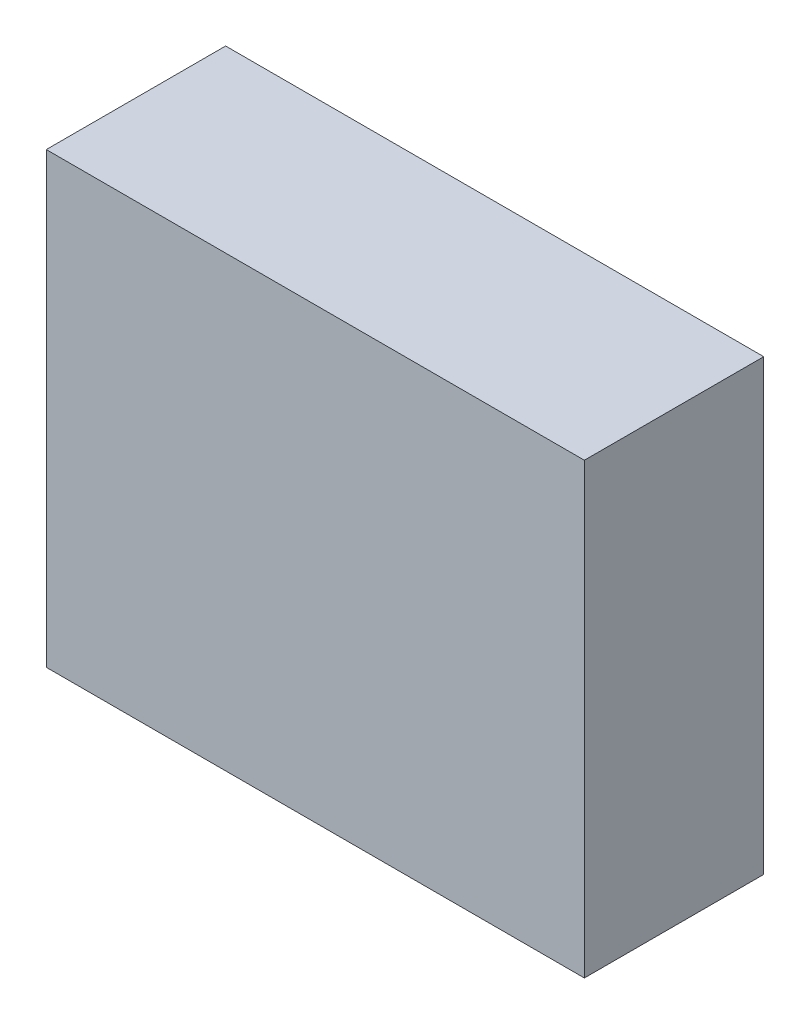
ISO-10303-21;
HEADER;
FILE_DESCRIPTION(('STEP AP214'),'2;1');
FILE_NAME('part.step','',(''),(''),'','','');
FILE_SCHEMA(('AUTOMOTIVE_DESIGN { 1 0 10303 214 1 1 1 1 }'));
ENDSEC;
DATA;
#1=APPLICATION_CONTEXT('core data for automotive mechanical design processes');
#2=APPLICATION_PROTOCOL_DEFINITION('international standard','automotive_design',2000,#1);
#3=PRODUCT_CONTEXT('',#1,'mechanical');
#4=PRODUCT('Part','Part','',(#3));
#5=PRODUCT_RELATED_PRODUCT_CATEGORY('part','',(#4));
#6=PRODUCT_DEFINITION_FORMATION('','',#4);
#7=PRODUCT_DEFINITION_CONTEXT('part definition',#1,'design');
#8=PRODUCT_DEFINITION('design','',#6,#7);
#9=PRODUCT_DEFINITION_SHAPE('','',#8);
#10=(LENGTH_UNIT() NAMED_UNIT(*) SI_UNIT(.MILLI.,.METRE.));
#11=(NAMED_UNIT(*) PLANE_ANGLE_UNIT() SI_UNIT($,.RADIAN.));
#12=(NAMED_UNIT(*) SI_UNIT($,.STERADIAN.) SOLID_ANGLE_UNIT());
#13=UNCERTAINTY_MEASURE_WITH_UNIT(LENGTH_MEASURE(1.E-05),#10,'distance_accuracy_value','');
#14=(GEOMETRIC_REPRESENTATION_CONTEXT(3) GLOBAL_UNCERTAINTY_ASSIGNED_CONTEXT((#13)) GLOBAL_UNIT_ASSIGNED_CONTEXT((#10,
#11,#12)) REPRESENTATION_CONTEXT('',''));
#15=CARTESIAN_POINT('',(0.,0.,0.));
#16=DIRECTION('',(0.,0.,1.));
#17=DIRECTION('',(1.,0.,0.));
#18=AXIS2_PLACEMENT_3D('',#15,#16,#17);
#19=CARTESIAN_POINT('',(0.381,0.3175,0.254));
#20=DIRECTION('',(0.,0.,-1.));
#21=DIRECTION('',(-1.,0.,0.));
#22=AXIS2_PLACEMENT_3D('',#19,#20,#21);
#23=PLANE('',#22);
#24=DIRECTION('',(0.,1.,0.));
#25=VECTOR('',#24,1.);
#26=CARTESIAN_POINT('',(-0.381,0.3175,0.254));
#27=LINE('',#26,#25);
#28=CARTESIAN_POINT('',(-0.381,0.3175,0.254));
#29=VERTEX_POINT('',#28);
#30=CARTESIAN_POINT('',(-0.381,-0.3175,0.254));
#31=VERTEX_POINT('',#30);
#32=EDGE_CURVE('E55',#29,#31,#27,.F.);
#33=ORIENTED_EDGE('',*,*,#32,.T.);
#34=DIRECTION('',(1.,0.,0.));
#35=VECTOR('',#34,1.);
#36=CARTESIAN_POINT('',(-0.381,-0.3175,0.254));
#37=LINE('',#36,#35);
#38=CARTESIAN_POINT('',(0.381,-0.3175,0.254));
#39=VERTEX_POINT('',#38);
#40=EDGE_CURVE('E57',#31,#39,#37,.T.);
#41=ORIENTED_EDGE('',*,*,#40,.T.);
#42=DIRECTION('',(0.,1.,0.));
#43=VECTOR('',#42,1.);
#44=CARTESIAN_POINT('',(0.381,-0.3175,0.254));
#45=LINE('',#44,#43);
#46=CARTESIAN_POINT('',(0.381,0.3175,0.254));
#47=VERTEX_POINT('',#46);
#48=EDGE_CURVE('E20',#39,#47,#45,.T.);
#49=ORIENTED_EDGE('',*,*,#48,.T.);
#50=DIRECTION('',(1.,0.,0.));
#51=VECTOR('',#50,1.);
#52=CARTESIAN_POINT('',(0.381,0.3175,0.254));
#53=LINE('',#52,#51);
#54=EDGE_CURVE('E80',#47,#29,#53,.F.);
#55=ORIENTED_EDGE('',*,*,#54,.T.);
#56=EDGE_LOOP('',(#33,#41,#49,#55));
#57=FACE_BOUND('',#56,.T.);
#58=ADVANCED_FACE('F17',(#57),#23,.F.);
#59=CARTESIAN_POINT('',(0.381,-0.3175,0.));
#60=DIRECTION('',(-1.,0.,0.));
#61=DIRECTION('',(0.,0.,1.));
#62=AXIS2_PLACEMENT_3D('',#59,#60,#61);
#63=PLANE('',#62);
#64=DIRECTION('',(0.,0.,-1.));
#65=VECTOR('',#64,1.);
#66=CARTESIAN_POINT('',(0.381,0.3175,0.));
#67=LINE('',#66,#65);
#68=CARTESIAN_POINT('',(0.381,0.3175,0.));
#69=VERTEX_POINT('',#68);
#70=EDGE_CURVE('E68',#69,#47,#67,.F.);
#71=ORIENTED_EDGE('',*,*,#70,.T.);
#72=ORIENTED_EDGE('',*,*,#48,.F.);
#73=DIRECTION('',(0.,0.,1.));
#74=VECTOR('',#73,1.);
#75=CARTESIAN_POINT('',(0.381,-0.3175,0.));
#76=LINE('',#75,#74);
#77=CARTESIAN_POINT('',(0.381,-0.3175,0.));
#78=VERTEX_POINT('',#77);
#79=EDGE_CURVE('E63',#39,#78,#76,.F.);
#80=ORIENTED_EDGE('',*,*,#79,.T.);
#81=DIRECTION('',(0.,1.,0.));
#82=VECTOR('',#81,1.);
#83=CARTESIAN_POINT('',(0.381,0.3175,0.));
#84=LINE('',#83,#82);
#85=EDGE_CURVE('E83',#69,#78,#84,.F.);
#86=ORIENTED_EDGE('',*,*,#85,.F.);
#87=EDGE_LOOP('',(#71,#72,#80,#86));
#88=FACE_BOUND('',#87,.T.);
#89=ADVANCED_FACE('F65',(#88),#63,.F.);
#90=CARTESIAN_POINT('',(-0.381,-0.3175,0.));
#91=DIRECTION('',(0.,1.,0.));
#92=DIRECTION('',(0.,0.,1.));
#93=AXIS2_PLACEMENT_3D('',#90,#91,#92);
#94=PLANE('',#93);
#95=ORIENTED_EDGE('',*,*,#79,.F.);
#96=ORIENTED_EDGE('',*,*,#40,.F.);
#97=DIRECTION('',(0.,0.,-1.));
#98=VECTOR('',#97,1.);
#99=CARTESIAN_POINT('',(-0.381,-0.3175,0.));
#100=LINE('',#99,#98);
#101=CARTESIAN_POINT('',(-0.381,-0.3175,0.));
#102=VERTEX_POINT('',#101);
#103=EDGE_CURVE('E75',#31,#102,#100,.T.);
#104=ORIENTED_EDGE('',*,*,#103,.T.);
#105=DIRECTION('',(-1.,0.,0.));
#106=VECTOR('',#105,1.);
#107=CARTESIAN_POINT('',(0.381,-0.3175,0.));
#108=LINE('',#107,#106);
#109=EDGE_CURVE('E72',#78,#102,#108,.T.);
#110=ORIENTED_EDGE('',*,*,#109,.F.);
#111=EDGE_LOOP('',(#95,#96,#104,#110));
#112=FACE_BOUND('',#111,.T.);
#113=ADVANCED_FACE('F70',(#112),#94,.F.);
#114=CARTESIAN_POINT('',(-0.381,0.3175,0.));
#115=DIRECTION('',(1.,0.,0.));
#116=DIRECTION('',(0.,0.,-1.));
#117=AXIS2_PLACEMENT_3D('',#114,#115,#116);
#118=PLANE('',#117);
#119=ORIENTED_EDGE('',*,*,#103,.F.);
#120=ORIENTED_EDGE('',*,*,#32,.F.);
#121=DIRECTION('',(0.,0.,-1.));
#122=VECTOR('',#121,1.);
#123=CARTESIAN_POINT('',(-0.381,0.3175,0.));
#124=LINE('',#123,#122);
#125=CARTESIAN_POINT('',(-0.381,0.3175,0.));
#126=VERTEX_POINT('',#125);
#127=EDGE_CURVE('E35',#29,#126,#124,.T.);
#128=ORIENTED_EDGE('',*,*,#127,.T.);
#129=DIRECTION('',(0.,1.,0.));
#130=VECTOR('',#129,1.);
#131=CARTESIAN_POINT('',(-0.381,0.3175,0.));
#132=LINE('',#131,#130);
#133=EDGE_CURVE('E26',#102,#126,#132,.T.);
#134=ORIENTED_EDGE('',*,*,#133,.F.);
#135=EDGE_LOOP('',(#119,#120,#128,#134));
#136=FACE_BOUND('',#135,.T.);
#137=ADVANCED_FACE('F89',(#136),#118,.F.);
#138=CARTESIAN_POINT('',(0.381,0.3175,0.));
#139=DIRECTION('',(0.,-1.,0.));
#140=DIRECTION('',(0.,0.,-1.));
#141=AXIS2_PLACEMENT_3D('',#138,#139,#140);
#142=PLANE('',#141);
#143=ORIENTED_EDGE('',*,*,#127,.F.);
#144=ORIENTED_EDGE('',*,*,#54,.F.);
#145=ORIENTED_EDGE('',*,*,#70,.F.);
#146=DIRECTION('',(-1.,0.,0.));
#147=VECTOR('',#146,1.);
#148=CARTESIAN_POINT('',(0.381,0.3175,0.));
#149=LINE('',#148,#147);
#150=EDGE_CURVE('E11',#126,#69,#149,.F.);
#151=ORIENTED_EDGE('',*,*,#150,.F.);
#152=EDGE_LOOP('',(#143,#144,#145,#151));
#153=FACE_BOUND('',#152,.T.);
#154=ADVANCED_FACE('F91',(#153),#142,.F.);
#155=CARTESIAN_POINT('',(0.381,0.3175,0.));
#156=DIRECTION('',(0.,0.,-1.));
#157=DIRECTION('',(-1.,0.,0.));
#158=AXIS2_PLACEMENT_3D('',#155,#156,#157);
#159=PLANE('',#158);
#160=ORIENTED_EDGE('',*,*,#133,.T.);
#161=ORIENTED_EDGE('',*,*,#150,.T.);
#162=ORIENTED_EDGE('',*,*,#85,.T.);
#163=ORIENTED_EDGE('',*,*,#109,.T.);
#164=EDGE_LOOP('',(#160,#161,#162,#163));
#165=FACE_BOUND('',#164,.T.);
#166=ADVANCED_FACE('F88',(#165),#159,.T.);
#167=CLOSED_SHELL('',(#58,#89,#113,#137,#154,#166));
#168=MANIFOLD_SOLID_BREP('B1',#167);
#169=ADVANCED_BREP_SHAPE_REPRESENTATION('',(#18,#168),#14);
#170=SHAPE_DEFINITION_REPRESENTATION(#9,#169);
ENDSEC;
END-ISO-10303-21;
